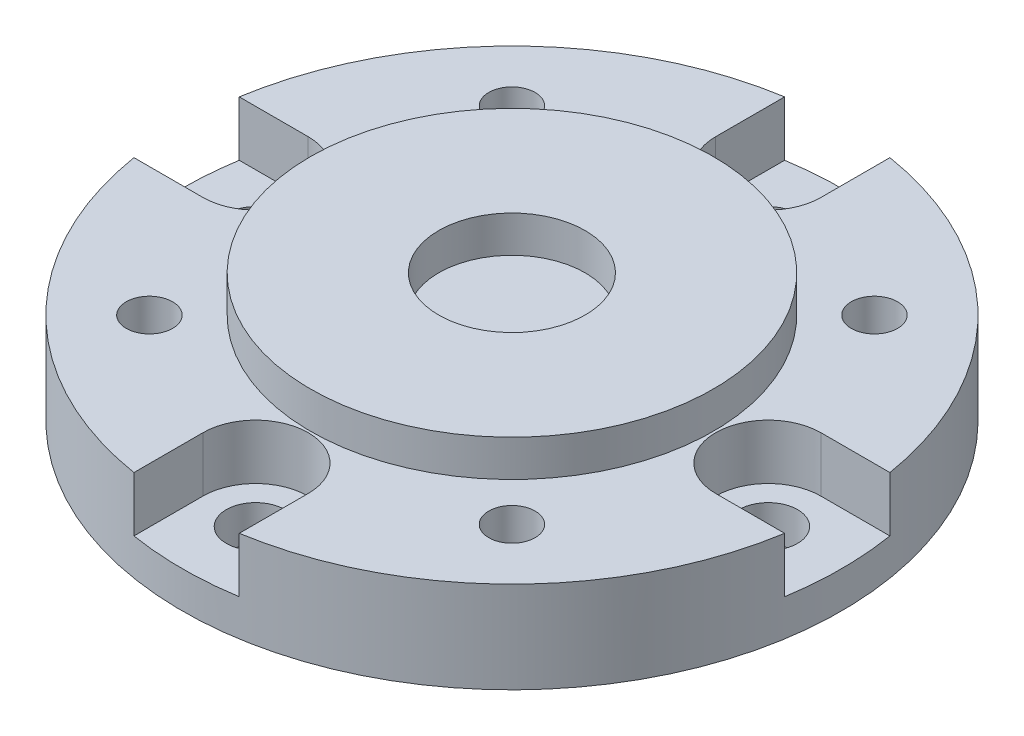
ISO-10303-21;
HEADER;
FILE_DESCRIPTION(('STEP AP214'),'2;1');
FILE_NAME('part.step','',(''),(''),'','','');
FILE_SCHEMA(('AUTOMOTIVE_DESIGN { 1 0 10303 214 1 1 1 1 }'));
ENDSEC;
DATA;
#1=APPLICATION_CONTEXT('core data for automotive mechanical design processes');
#2=APPLICATION_PROTOCOL_DEFINITION('international standard','automotive_design',2000,#1);
#3=PRODUCT_CONTEXT('',#1,'mechanical');
#4=PRODUCT('Part','Part','',(#3));
#5=PRODUCT_RELATED_PRODUCT_CATEGORY('part','',(#4));
#6=PRODUCT_DEFINITION_FORMATION('','',#4);
#7=PRODUCT_DEFINITION_CONTEXT('part definition',#1,'design');
#8=PRODUCT_DEFINITION('design','',#6,#7);
#9=PRODUCT_DEFINITION_SHAPE('','',#8);
#10=(LENGTH_UNIT() NAMED_UNIT(*) SI_UNIT(.MILLI.,.METRE.));
#11=(NAMED_UNIT(*) PLANE_ANGLE_UNIT() SI_UNIT($,.RADIAN.));
#12=(NAMED_UNIT(*) SI_UNIT($,.STERADIAN.) SOLID_ANGLE_UNIT());
#13=UNCERTAINTY_MEASURE_WITH_UNIT(LENGTH_MEASURE(1.E-05),#10,'distance_accuracy_value','');
#14=(GEOMETRIC_REPRESENTATION_CONTEXT(3) GLOBAL_UNCERTAINTY_ASSIGNED_CONTEXT((#13)) GLOBAL_UNIT_ASSIGNED_CONTEXT((#10,
#11,#12)) REPRESENTATION_CONTEXT('',''));
#15=CARTESIAN_POINT('',(0.,0.,0.));
#16=DIRECTION('',(0.,0.,1.));
#17=DIRECTION('',(1.,0.,0.));
#18=AXIS2_PLACEMENT_3D('',#15,#16,#17);
#19=CARTESIAN_POINT('',(0.,72.5,0.));
#20=DIRECTION('',(0.,1.,0.));
#21=DIRECTION('',(1.,0.,0.));
#22=AXIS2_PLACEMENT_3D('',#19,#20,#21);
#23=PLANE('',#22);
#24=CARTESIAN_POINT('',(-9.89949493661174,72.5,9.89949493661166));
#25=DIRECTION('',(0.,1.,0.));
#26=DIRECTION('',(0.,0.,1.));
#27=AXIS2_PLACEMENT_3D('',#24,#25,#26);
#28=CIRCLE('',#27,1.2645);
#29=CARTESIAN_POINT('',(-9.89949493661174,72.5,8.63499493661166));
#30=VERTEX_POINT('',#29);
#31=EDGE_CURVE('E444',#30,#30,#28,.T.);
#32=ORIENTED_EDGE('',*,*,#31,.T.);
#33=EDGE_LOOP('',(#32));
#34=FACE_BOUND('',#33,.T.);
#35=CARTESIAN_POINT('',(9.8994949366116,72.5,-9.89949493661166));
#36=DIRECTION('',(0.,1.,0.));
#37=DIRECTION('',(0.,0.,1.));
#38=AXIS2_PLACEMENT_3D('',#35,#36,#37);
#39=CIRCLE('',#38,1.2645);
#40=CARTESIAN_POINT('',(9.8994949366116,72.5,-11.1639949366117));
#41=VERTEX_POINT('',#40);
#42=EDGE_CURVE('E430',#41,#41,#39,.T.);
#43=ORIENTED_EDGE('',*,*,#42,.T.);
#44=EDGE_LOOP('',(#43));
#45=FACE_BOUND('',#44,.T.);
#46=CARTESIAN_POINT('',(9.89949493661159,72.5,9.89949493661166));
#47=DIRECTION('',(0.,1.,0.));
#48=DIRECTION('',(0.,0.,1.));
#49=AXIS2_PLACEMENT_3D('',#46,#47,#48);
#50=CIRCLE('',#49,1.2645);
#51=CARTESIAN_POINT('',(9.89949493661159,72.5,8.63499493661166));
#52=VERTEX_POINT('',#51);
#53=EDGE_CURVE('E455',#52,#52,#50,.T.);
#54=ORIENTED_EDGE('',*,*,#53,.T.);
#55=EDGE_LOOP('',(#54));
#56=FACE_BOUND('',#55,.T.);
#57=CARTESIAN_POINT('',(-9.89949493661174,72.5,-9.89949493661166));
#58=DIRECTION('',(0.,1.,0.));
#59=DIRECTION('',(0.,0.,1.));
#60=AXIS2_PLACEMENT_3D('',#57,#58,#59);
#61=CIRCLE('',#60,1.2645);
#62=CARTESIAN_POINT('',(-9.89949493661174,72.5,-11.1639949366117));
#63=VERTEX_POINT('',#62);
#64=EDGE_CURVE('E426',#63,#63,#61,.T.);
#65=ORIENTED_EDGE('',*,*,#64,.T.);
#66=EDGE_LOOP('',(#65));
#67=FACE_BOUND('',#66,.T.);
#68=CARTESIAN_POINT('',(0.,72.5,14.));
#69=DIRECTION('',(0.,1.,0.));
#70=DIRECTION('',(0.,0.,1.));
#71=AXIS2_PLACEMENT_3D('',#68,#69,#70);
#72=CIRCLE('',#71,1.6);
#73=CARTESIAN_POINT('',(0.,72.5,15.6));
#74=VERTEX_POINT('',#73);
#75=CARTESIAN_POINT('',(0.,72.5,12.4));
#76=VERTEX_POINT('',#75);
#77=EDGE_CURVE('E373',#74,#76,#72,.T.);
#78=ORIENTED_EDGE('',*,*,#77,.T.);
#79=CARTESIAN_POINT('',(0.,72.5,14.));
#80=DIRECTION('',(0.,1.,0.));
#81=DIRECTION('',(0.,0.,1.));
#82=AXIS2_PLACEMENT_3D('',#79,#80,#81);
#83=CIRCLE('',#82,1.6);
#84=EDGE_CURVE('E369',#76,#74,#83,.T.);
#85=ORIENTED_EDGE('',*,*,#84,.T.);
#86=EDGE_LOOP('',(#78,#85));
#87=FACE_BOUND('',#86,.T.);
#88=CARTESIAN_POINT('',(0.,72.5,-14.));
#89=DIRECTION('',(0.,1.,0.));
#90=DIRECTION('',(0.,0.,1.));
#91=AXIS2_PLACEMENT_3D('',#88,#89,#90);
#92=CIRCLE('',#91,1.6);
#93=CARTESIAN_POINT('',(0.,72.5,-12.4));
#94=VERTEX_POINT('',#93);
#95=CARTESIAN_POINT('',(0.,72.5,-15.6));
#96=VERTEX_POINT('',#95);
#97=EDGE_CURVE('E337',#94,#96,#92,.T.);
#98=ORIENTED_EDGE('',*,*,#97,.T.);
#99=CARTESIAN_POINT('',(0.,72.5,-14.));
#100=DIRECTION('',(0.,1.,0.));
#101=DIRECTION('',(0.,0.,1.));
#102=AXIS2_PLACEMENT_3D('',#99,#100,#101);
#103=CIRCLE('',#102,1.6);
#104=EDGE_CURVE('E341',#96,#94,#103,.T.);
#105=ORIENTED_EDGE('',*,*,#104,.T.);
#106=EDGE_LOOP('',(#98,#105));
#107=FACE_BOUND('',#106,.T.);
#108=CARTESIAN_POINT('',(-14.,72.5,0.));
#109=DIRECTION('',(0.,1.,0.));
#110=DIRECTION('',(0.,0.,1.));
#111=AXIS2_PLACEMENT_3D('',#108,#109,#110);
#112=CIRCLE('',#111,1.6);
#113=CARTESIAN_POINT('',(-14.,72.5,1.6));
#114=VERTEX_POINT('',#113);
#115=CARTESIAN_POINT('',(-14.,72.5,-1.6));
#116=VERTEX_POINT('',#115);
#117=EDGE_CURVE('E536',#114,#116,#112,.T.);
#118=ORIENTED_EDGE('',*,*,#117,.T.);
#119=CARTESIAN_POINT('',(-14.,72.5,0.));
#120=DIRECTION('',(0.,1.,0.));
#121=DIRECTION('',(0.,0.,1.));
#122=AXIS2_PLACEMENT_3D('',#119,#120,#121);
#123=CIRCLE('',#122,1.6);
#124=EDGE_CURVE('E306',#116,#114,#123,.T.);
#125=ORIENTED_EDGE('',*,*,#124,.T.);
#126=EDGE_LOOP('',(#118,#125));
#127=FACE_BOUND('',#126,.T.);
#128=CARTESIAN_POINT('',(14.,72.5,0.));
#129=DIRECTION('',(0.,1.,0.));
#130=DIRECTION('',(0.,0.,1.));
#131=AXIS2_PLACEMENT_3D('',#128,#129,#130);
#132=CIRCLE('',#131,1.6);
#133=CARTESIAN_POINT('',(14.,72.5,1.6));
#134=VERTEX_POINT('',#133);
#135=CARTESIAN_POINT('',(14.,72.5,-1.6));
#136=VERTEX_POINT('',#135);
#137=EDGE_CURVE('E363',#134,#136,#132,.T.);
#138=ORIENTED_EDGE('',*,*,#137,.T.);
#139=CARTESIAN_POINT('',(14.,72.5,0.));
#140=DIRECTION('',(0.,1.,0.));
#141=DIRECTION('',(0.,0.,1.));
#142=AXIS2_PLACEMENT_3D('',#139,#140,#141);
#143=CIRCLE('',#142,1.6);
#144=EDGE_CURVE('E359',#136,#134,#143,.T.);
#145=ORIENTED_EDGE('',*,*,#144,.T.);
#146=EDGE_LOOP('',(#138,#145));
#147=FACE_BOUND('',#146,.T.);
#148=CARTESIAN_POINT('',(0.,72.5,0.));
#149=DIRECTION('',(0.,-1.,0.));
#150=DIRECTION('',(1.,0.,0.));
#151=AXIS2_PLACEMENT_3D('',#148,#149,#150);
#152=CIRCLE('',#151,18.);
#153=CARTESIAN_POINT('',(-18.,72.5,0.));
#154=VERTEX_POINT('',#153);
#155=EDGE_CURVE('E19',#154,#154,#152,.T.);
#156=ORIENTED_EDGE('',*,*,#155,.T.);
#157=EDGE_LOOP('',(#156));
#158=FACE_BOUND('',#157,.T.);
#159=ADVANCED_FACE('F15',(#34,#45,#56,#67,#87,#107,#127,#147,#158),#23,.F.);
#160=CARTESIAN_POINT('',(0.,77.5,0.));
#161=DIRECTION('',(0.,1.,0.));
#162=DIRECTION('',(1.,0.,0.));
#163=AXIS2_PLACEMENT_3D('',#160,#161,#162);
#164=PLANE('',#163);
#165=CARTESIAN_POINT('',(0.,77.5,0.));
#166=DIRECTION('',(0.,1.,0.));
#167=DIRECTION('',(1.,0.,0.));
#168=AXIS2_PLACEMENT_3D('',#165,#166,#167);
#169=CIRCLE('',#168,4.);
#170=CARTESIAN_POINT('',(-4.00000000000007,77.5,0.));
#171=VERTEX_POINT('',#170);
#172=EDGE_CURVE('E327',#171,#171,#169,.T.);
#173=ORIENTED_EDGE('',*,*,#172,.T.);
#174=EDGE_LOOP('',(#173));
#175=FACE_BOUND('',#174,.T.);
#176=ADVANCED_FACE('F723',(#175),#164,.T.);
#177=CARTESIAN_POINT('',(0.,77.5,0.));
#178=DIRECTION('',(0.,-1.,0.));
#179=DIRECTION('',(1.,0.,0.));
#180=AXIS2_PLACEMENT_3D('',#177,#178,#179);
#181=CYLINDRICAL_SURFACE('',#180,18.);
#182=ORIENTED_EDGE('',*,*,#155,.F.);
#183=DIRECTION('',(0.,1.,0.));
#184=VECTOR('',#183,1.);
#185=CARTESIAN_POINT('',(-18.,77.5,0.));
#186=LINE('',#185,#184);
#187=CARTESIAN_POINT('',(-18.,74.5,0.));
#188=VERTEX_POINT('',#187);
#189=EDGE_CURVE('E10',#154,#188,#186,.T.);
#190=ORIENTED_EDGE('',*,*,#189,.T.);
#191=CARTESIAN_POINT('',(0.,74.5,0.));
#192=DIRECTION('',(0.,-1.,0.));
#193=DIRECTION('',(1.,0.,0.));
#194=AXIS2_PLACEMENT_3D('',#191,#192,#193);
#195=CIRCLE('',#194,18.);
#196=CARTESIAN_POINT('',(-17.7689159770652,74.5,-2.875));
#197=VERTEX_POINT('',#196);
#198=EDGE_CURVE('E478',#188,#197,#195,.T.);
#199=ORIENTED_EDGE('',*,*,#198,.T.);
#200=DIRECTION('',(0.,1.,0.));
#201=VECTOR('',#200,1.);
#202=CARTESIAN_POINT('',(-17.7689159770652,77.5,-2.875));
#203=LINE('',#202,#201);
#204=CARTESIAN_POINT('',(-17.7689159770652,77.5,-2.875));
#205=VERTEX_POINT('',#204);
#206=EDGE_CURVE('E499',#197,#205,#203,.T.);
#207=ORIENTED_EDGE('',*,*,#206,.T.);
#208=CARTESIAN_POINT('',(0.,77.5,0.));
#209=DIRECTION('',(0.,1.,0.));
#210=DIRECTION('',(1.,0.,0.));
#211=AXIS2_PLACEMENT_3D('',#208,#209,#210);
#212=CIRCLE('',#211,18.);
#213=CARTESIAN_POINT('',(-2.87500000000007,77.5,-17.7689159770651));
#214=VERTEX_POINT('',#213);
#215=EDGE_CURVE('E314',#214,#205,#212,.T.);
#216=ORIENTED_EDGE('',*,*,#215,.F.);
#217=DIRECTION('',(0.,-1.,0.));
#218=VECTOR('',#217,1.);
#219=CARTESIAN_POINT('',(-2.87500000000007,77.5,-17.7689159770651));
#220=LINE('',#219,#218);
#221=CARTESIAN_POINT('',(-2.87500000000007,74.5,-17.7689159770651));
#222=VERTEX_POINT('',#221);
#223=EDGE_CURVE('E345',#214,#222,#220,.T.);
#224=ORIENTED_EDGE('',*,*,#223,.T.);
#225=CARTESIAN_POINT('',(0.,74.5,0.));
#226=DIRECTION('',(0.,-1.,0.));
#227=DIRECTION('',(1.,0.,0.));
#228=AXIS2_PLACEMENT_3D('',#225,#226,#227);
#229=CIRCLE('',#228,18.);
#230=CARTESIAN_POINT('',(2.87499999999993,74.5,-17.7689159770651));
#231=VERTEX_POINT('',#230);
#232=EDGE_CURVE('E282',#222,#231,#229,.T.);
#233=ORIENTED_EDGE('',*,*,#232,.T.);
#234=DIRECTION('',(0.,1.,0.));
#235=VECTOR('',#234,1.);
#236=CARTESIAN_POINT('',(2.87499999999993,77.5,-17.7689159770651));
#237=LINE('',#236,#235);
#238=CARTESIAN_POINT('',(2.87499999999993,77.5,-17.7689159770651));
#239=VERTEX_POINT('',#238);
#240=EDGE_CURVE('E296',#231,#239,#237,.T.);
#241=ORIENTED_EDGE('',*,*,#240,.T.);
#242=CARTESIAN_POINT('',(0.,77.5,0.));
#243=DIRECTION('',(0.,1.,0.));
#244=DIRECTION('',(1.,0.,0.));
#245=AXIS2_PLACEMENT_3D('',#242,#243,#244);
#246=CIRCLE('',#245,18.);
#247=CARTESIAN_POINT('',(17.768915977065,77.5,-2.875));
#248=VERTEX_POINT('',#247);
#249=EDGE_CURVE('E335',#248,#239,#246,.T.);
#250=ORIENTED_EDGE('',*,*,#249,.F.);
#251=DIRECTION('',(0.,-1.,0.));
#252=VECTOR('',#251,1.);
#253=CARTESIAN_POINT('',(17.768915977065,77.5,-2.875));
#254=LINE('',#253,#252);
#255=CARTESIAN_POINT('',(17.768915977065,74.5,-2.875));
#256=VERTEX_POINT('',#255);
#257=EDGE_CURVE('E353',#248,#256,#254,.T.);
#258=ORIENTED_EDGE('',*,*,#257,.T.);
#259=CARTESIAN_POINT('',(0.,74.5,0.));
#260=DIRECTION('',(0.,-1.,0.));
#261=DIRECTION('',(1.,0.,0.));
#262=AXIS2_PLACEMENT_3D('',#259,#260,#261);
#263=CIRCLE('',#262,18.);
#264=CARTESIAN_POINT('',(17.768915977065,74.5,2.875));
#265=VERTEX_POINT('',#264);
#266=EDGE_CURVE('E493',#256,#265,#263,.T.);
#267=ORIENTED_EDGE('',*,*,#266,.T.);
#268=DIRECTION('',(0.,1.,0.));
#269=VECTOR('',#268,1.);
#270=CARTESIAN_POINT('',(17.768915977065,77.5,2.875));
#271=LINE('',#270,#269);
#272=CARTESIAN_POINT('',(17.768915977065,77.5,2.875));
#273=VERTEX_POINT('',#272);
#274=EDGE_CURVE('E549',#265,#273,#271,.T.);
#275=ORIENTED_EDGE('',*,*,#274,.T.);
#276=CARTESIAN_POINT('',(0.,77.5,0.));
#277=DIRECTION('',(0.,1.,0.));
#278=DIRECTION('',(1.,0.,0.));
#279=AXIS2_PLACEMENT_3D('',#276,#277,#278);
#280=CIRCLE('',#279,18.);
#281=CARTESIAN_POINT('',(2.87499999999993,77.5,17.7689159770651));
#282=VERTEX_POINT('',#281);
#283=EDGE_CURVE('E332',#282,#273,#280,.T.);
#284=ORIENTED_EDGE('',*,*,#283,.F.);
#285=DIRECTION('',(0.,-1.,0.));
#286=VECTOR('',#285,1.);
#287=CARTESIAN_POINT('',(2.87499999999993,77.5,17.7689159770651));
#288=LINE('',#287,#286);
#289=CARTESIAN_POINT('',(2.87499999999993,74.5,17.7689159770651));
#290=VERTEX_POINT('',#289);
#291=EDGE_CURVE('E490',#282,#290,#288,.T.);
#292=ORIENTED_EDGE('',*,*,#291,.T.);
#293=CARTESIAN_POINT('',(0.,74.5,0.));
#294=DIRECTION('',(0.,-1.,0.));
#295=DIRECTION('',(1.,0.,0.));
#296=AXIS2_PLACEMENT_3D('',#293,#294,#295);
#297=CIRCLE('',#296,18.);
#298=CARTESIAN_POINT('',(-2.87500000000007,74.5,17.7689159770651));
#299=VERTEX_POINT('',#298);
#300=EDGE_CURVE('E374',#290,#299,#297,.T.);
#301=ORIENTED_EDGE('',*,*,#300,.T.);
#302=DIRECTION('',(0.,1.,0.));
#303=VECTOR('',#302,1.);
#304=CARTESIAN_POINT('',(-2.87500000000007,77.5,17.7689159770651));
#305=LINE('',#304,#303);
#306=CARTESIAN_POINT('',(-2.87500000000007,77.5,17.7689159770651));
#307=VERTEX_POINT('',#306);
#308=EDGE_CURVE('E575',#299,#307,#305,.T.);
#309=ORIENTED_EDGE('',*,*,#308,.T.);
#310=CARTESIAN_POINT('',(0.,77.5,0.));
#311=DIRECTION('',(0.,1.,0.));
#312=DIRECTION('',(1.,0.,0.));
#313=AXIS2_PLACEMENT_3D('',#310,#311,#312);
#314=CIRCLE('',#313,18.);
#315=CARTESIAN_POINT('',(-17.7689159770652,77.5,2.875));
#316=VERTEX_POINT('',#315);
#317=EDGE_CURVE('E336',#316,#307,#314,.T.);
#318=ORIENTED_EDGE('',*,*,#317,.F.);
#319=DIRECTION('',(0.,-1.,0.));
#320=VECTOR('',#319,1.);
#321=CARTESIAN_POINT('',(-17.7689159770652,77.5,2.875));
#322=LINE('',#321,#320);
#323=CARTESIAN_POINT('',(-17.7689159770652,74.5,2.875));
#324=VERTEX_POINT('',#323);
#325=EDGE_CURVE('E351',#316,#324,#322,.T.);
#326=ORIENTED_EDGE('',*,*,#325,.T.);
#327=CARTESIAN_POINT('',(0.,74.5,0.));
#328=DIRECTION('',(0.,-1.,0.));
#329=DIRECTION('',(1.,0.,0.));
#330=AXIS2_PLACEMENT_3D('',#327,#328,#329);
#331=CIRCLE('',#330,18.);
#332=EDGE_CURVE('E479',#324,#188,#331,.T.);
#333=ORIENTED_EDGE('',*,*,#332,.T.);
#334=ORIENTED_EDGE('',*,*,#189,.F.);
#335=EDGE_LOOP('',(#182,#190,#199,#207,#216,#224,#233,#241,#250,#258,#267,#275,#284,#292,#301,
#309,#318,#326,#333,#334));
#336=FACE_BOUND('',#335,.T.);
#337=ADVANCED_FACE('F17',(#336),#181,.T.);
#338=CARTESIAN_POINT('',(0.,79.5,0.));
#339=DIRECTION('',(0.,1.,0.));
#340=DIRECTION('',(1.,0.,0.));
#341=AXIS2_PLACEMENT_3D('',#338,#339,#340);
#342=PLANE('',#341);
#343=CARTESIAN_POINT('',(0.,79.5,0.));
#344=DIRECTION('',(0.,-1.,0.));
#345=DIRECTION('',(1.,0.,0.));
#346=AXIS2_PLACEMENT_3D('',#343,#344,#345);
#347=CIRCLE('',#346,4.);
#348=CARTESIAN_POINT('',(-4.00000000000007,79.5,0.));
#349=VERTEX_POINT('',#348);
#350=EDGE_CURVE('E436',#349,#349,#347,.T.);
#351=ORIENTED_EDGE('',*,*,#350,.T.);
#352=EDGE_LOOP('',(#351));
#353=FACE_BOUND('',#352,.T.);
#354=CARTESIAN_POINT('',(0.,79.5,0.));
#355=DIRECTION('',(0.,1.,0.));
#356=DIRECTION('',(1.,0.,0.));
#357=AXIS2_PLACEMENT_3D('',#354,#355,#356);
#358=CIRCLE('',#357,11.);
#359=CARTESIAN_POINT('',(-11.,79.5,0.));
#360=VERTEX_POINT('',#359);
#361=EDGE_CURVE('E330',#360,#360,#358,.T.);
#362=ORIENTED_EDGE('',*,*,#361,.T.);
#363=EDGE_LOOP('',(#362));
#364=FACE_BOUND('',#363,.T.);
#365=ADVANCED_FACE('F745',(#353,#364),#342,.T.);
#366=CARTESIAN_POINT('',(0.,77.5,0.));
#367=DIRECTION('',(0.,1.,0.));
#368=DIRECTION('',(1.,0.,0.));
#369=AXIS2_PLACEMENT_3D('',#366,#367,#368);
#370=CYLINDRICAL_SURFACE('',#369,11.);
#371=ORIENTED_EDGE('',*,*,#361,.F.);
#372=DIRECTION('',(0.,-1.,0.));
#373=VECTOR('',#372,1.);
#374=CARTESIAN_POINT('',(-11.,77.5,0.));
#375=LINE('',#374,#373);
#376=CARTESIAN_POINT('',(-11.,77.5,0.));
#377=VERTEX_POINT('',#376);
#378=EDGE_CURVE('E386',#360,#377,#375,.T.);
#379=ORIENTED_EDGE('',*,*,#378,.T.);
#380=CARTESIAN_POINT('',(0.,77.5,0.));
#381=DIRECTION('',(0.,-1.,0.));
#382=DIRECTION('',(1.,0.,0.));
#383=AXIS2_PLACEMENT_3D('',#380,#381,#382);
#384=CIRCLE('',#383,11.);
#385=EDGE_CURVE('E309',#377,#377,#384,.T.);
#386=ORIENTED_EDGE('',*,*,#385,.F.);
#387=ORIENTED_EDGE('',*,*,#378,.F.);
#388=EDGE_LOOP('',(#371,#379,#386,#387));
#389=FACE_BOUND('',#388,.T.);
#390=ADVANCED_FACE('F743',(#389),#370,.T.);
#391=CARTESIAN_POINT('',(0.,77.5,0.));
#392=DIRECTION('',(0.,1.,0.));
#393=DIRECTION('',(1.,0.,0.));
#394=AXIS2_PLACEMENT_3D('',#391,#392,#393);
#395=CYLINDRICAL_SURFACE('',#394,4.);
#396=ORIENTED_EDGE('',*,*,#350,.F.);
#397=DIRECTION('',(0.,-1.,0.));
#398=VECTOR('',#397,1.);
#399=CARTESIAN_POINT('',(-4.00000000000007,77.5,0.));
#400=LINE('',#399,#398);
#401=EDGE_CURVE('E331',#349,#171,#400,.T.);
#402=ORIENTED_EDGE('',*,*,#401,.T.);
#403=ORIENTED_EDGE('',*,*,#172,.F.);
#404=ORIENTED_EDGE('',*,*,#401,.F.);
#405=EDGE_LOOP('',(#396,#402,#403,#404));
#406=FACE_BOUND('',#405,.T.);
#407=ADVANCED_FACE('F753',(#406),#395,.F.);
#408=CARTESIAN_POINT('',(-9.89949493661174,73.5,9.89949493661166));
#409=DIRECTION('',(0.,-1.,0.));
#410=DIRECTION('',(0.,0.,1.));
#411=AXIS2_PLACEMENT_3D('',#408,#409,#410);
#412=CYLINDRICAL_SURFACE('',#411,1.2645);
#413=CARTESIAN_POINT('',(-9.89949493661174,77.5,9.89949493661166));
#414=DIRECTION('',(0.,-1.,0.));
#415=DIRECTION('',(0.,0.,1.));
#416=AXIS2_PLACEMENT_3D('',#413,#414,#415);
#417=CIRCLE('',#416,1.2645);
#418=CARTESIAN_POINT('',(-9.89949493661174,77.5,11.1639949366117));
#419=VERTEX_POINT('',#418);
#420=CARTESIAN_POINT('',(-9.89949493661174,77.5,8.63499493661166));
#421=VERTEX_POINT('',#420);
#422=EDGE_CURVE('E313',#419,#421,#417,.T.);
#423=ORIENTED_EDGE('',*,*,#422,.F.);
#424=CARTESIAN_POINT('',(-9.89949493661174,77.5,9.89949493661166));
#425=DIRECTION('',(0.,-1.,0.));
#426=DIRECTION('',(0.,0.,1.));
#427=AXIS2_PLACEMENT_3D('',#424,#425,#426);
#428=CIRCLE('',#427,1.2645);
#429=EDGE_CURVE('E320',#421,#419,#428,.T.);
#430=ORIENTED_EDGE('',*,*,#429,.F.);
#431=DIRECTION('',(0.,-1.,0.));
#432=VECTOR('',#431,1.);
#433=CARTESIAN_POINT('',(-9.89949493661174,73.5,8.63499493661166));
#434=LINE('',#433,#432);
#435=EDGE_CURVE('E432',#421,#30,#434,.T.);
#436=ORIENTED_EDGE('',*,*,#435,.T.);
#437=ORIENTED_EDGE('',*,*,#31,.F.);
#438=ORIENTED_EDGE('',*,*,#435,.F.);
#439=EDGE_LOOP('',(#423,#430,#436,#437,#438));
#440=FACE_BOUND('',#439,.T.);
#441=ADVANCED_FACE('F595',(#440),#412,.F.);
#442=CARTESIAN_POINT('',(9.8994949366116,73.5,-9.89949493661166));
#443=DIRECTION('',(0.,-1.,0.));
#444=DIRECTION('',(0.,0.,1.));
#445=AXIS2_PLACEMENT_3D('',#442,#443,#444);
#446=CYLINDRICAL_SURFACE('',#445,1.2645);
#447=CARTESIAN_POINT('',(9.8994949366116,77.5,-9.89949493661166));
#448=DIRECTION('',(0.,-1.,0.));
#449=DIRECTION('',(0.,0.,1.));
#450=AXIS2_PLACEMENT_3D('',#447,#448,#449);
#451=CIRCLE('',#450,1.2645);
#452=CARTESIAN_POINT('',(9.8994949366116,77.5,-8.63499493661166));
#453=VERTEX_POINT('',#452);
#454=CARTESIAN_POINT('',(9.8994949366116,77.5,-11.1639949366117));
#455=VERTEX_POINT('',#454);
#456=EDGE_CURVE('E315',#453,#455,#451,.T.);
#457=ORIENTED_EDGE('',*,*,#456,.F.);
#458=CARTESIAN_POINT('',(9.8994949366116,77.5,-9.89949493661166));
#459=DIRECTION('',(0.,-1.,0.));
#460=DIRECTION('',(0.,0.,1.));
#461=AXIS2_PLACEMENT_3D('',#458,#459,#460);
#462=CIRCLE('',#461,1.2645);
#463=EDGE_CURVE('E319',#455,#453,#462,.T.);
#464=ORIENTED_EDGE('',*,*,#463,.F.);
#465=DIRECTION('',(0.,-1.,0.));
#466=VECTOR('',#465,1.);
#467=CARTESIAN_POINT('',(9.8994949366116,73.5,-11.1639949366117));
#468=LINE('',#467,#466);
#469=EDGE_CURVE('E433',#455,#41,#468,.T.);
#470=ORIENTED_EDGE('',*,*,#469,.T.);
#471=ORIENTED_EDGE('',*,*,#42,.F.);
#472=ORIENTED_EDGE('',*,*,#469,.F.);
#473=EDGE_LOOP('',(#457,#464,#470,#471,#472));
#474=FACE_BOUND('',#473,.T.);
#475=ADVANCED_FACE('F774',(#474),#446,.F.);
#476=CARTESIAN_POINT('',(9.89949493661159,73.5,9.89949493661166));
#477=DIRECTION('',(0.,-1.,0.));
#478=DIRECTION('',(0.,0.,1.));
#479=AXIS2_PLACEMENT_3D('',#476,#477,#478);
#480=CYLINDRICAL_SURFACE('',#479,1.2645);
#481=CARTESIAN_POINT('',(9.89949493661159,77.5,9.89949493661166));
#482=DIRECTION('',(0.,-1.,0.));
#483=DIRECTION('',(0.,0.,1.));
#484=AXIS2_PLACEMENT_3D('',#481,#482,#483);
#485=CIRCLE('',#484,1.2645);
#486=CARTESIAN_POINT('',(9.89949493661159,77.5,11.1639949366117));
#487=VERTEX_POINT('',#486);
#488=CARTESIAN_POINT('',(9.89949493661159,77.5,8.63499493661166));
#489=VERTEX_POINT('',#488);
#490=EDGE_CURVE('E326',#487,#489,#485,.T.);
#491=ORIENTED_EDGE('',*,*,#490,.F.);
#492=CARTESIAN_POINT('',(9.89949493661159,77.5,9.89949493661166));
#493=DIRECTION('',(0.,-1.,0.));
#494=DIRECTION('',(0.,0.,1.));
#495=AXIS2_PLACEMENT_3D('',#492,#493,#494);
#496=CIRCLE('',#495,1.2645);
#497=EDGE_CURVE('E321',#489,#487,#496,.T.);
#498=ORIENTED_EDGE('',*,*,#497,.F.);
#499=DIRECTION('',(0.,-1.,0.));
#500=VECTOR('',#499,1.);
#501=CARTESIAN_POINT('',(9.89949493661159,73.5,8.63499493661166));
#502=LINE('',#501,#500);
#503=EDGE_CURVE('E429',#489,#52,#502,.T.);
#504=ORIENTED_EDGE('',*,*,#503,.T.);
#505=ORIENTED_EDGE('',*,*,#53,.F.);
#506=ORIENTED_EDGE('',*,*,#503,.F.);
#507=EDGE_LOOP('',(#491,#498,#504,#505,#506));
#508=FACE_BOUND('',#507,.T.);
#509=ADVANCED_FACE('F786',(#508),#480,.F.);
#510=CARTESIAN_POINT('',(-9.89949493661174,73.5,-9.89949493661166));
#511=DIRECTION('',(0.,-1.,0.));
#512=DIRECTION('',(0.,0.,1.));
#513=AXIS2_PLACEMENT_3D('',#510,#511,#512);
#514=CYLINDRICAL_SURFACE('',#513,1.2645);
#515=CARTESIAN_POINT('',(-9.89949493661174,77.5,-9.89949493661166));
#516=DIRECTION('',(0.,-1.,0.));
#517=DIRECTION('',(0.,0.,1.));
#518=AXIS2_PLACEMENT_3D('',#515,#516,#517);
#519=CIRCLE('',#518,1.2645);
#520=CARTESIAN_POINT('',(-9.89949493661174,77.5,-8.63499493661166));
#521=VERTEX_POINT('',#520);
#522=CARTESIAN_POINT('',(-9.89949493661174,77.5,-11.1639949366117));
#523=VERTEX_POINT('',#522);
#524=EDGE_CURVE('E325',#521,#523,#519,.T.);
#525=ORIENTED_EDGE('',*,*,#524,.F.);
#526=CARTESIAN_POINT('',(-9.89949493661174,77.5,-9.89949493661166));
#527=DIRECTION('',(0.,-1.,0.));
#528=DIRECTION('',(0.,0.,1.));
#529=AXIS2_PLACEMENT_3D('',#526,#527,#528);
#530=CIRCLE('',#529,1.2645);
#531=EDGE_CURVE('E389',#523,#521,#530,.T.);
#532=ORIENTED_EDGE('',*,*,#531,.F.);
#533=DIRECTION('',(0.,-1.,0.));
#534=VECTOR('',#533,1.);
#535=CARTESIAN_POINT('',(-9.89949493661174,73.5,-11.1639949366117));
#536=LINE('',#535,#534);
#537=EDGE_CURVE('E422',#523,#63,#536,.T.);
#538=ORIENTED_EDGE('',*,*,#537,.T.);
#539=ORIENTED_EDGE('',*,*,#64,.F.);
#540=ORIENTED_EDGE('',*,*,#537,.F.);
#541=EDGE_LOOP('',(#525,#532,#538,#539,#540));
#542=FACE_BOUND('',#541,.T.);
#543=ADVANCED_FACE('F642',(#542),#514,.F.);
#544=CARTESIAN_POINT('',(0.,77.5,0.));
#545=DIRECTION('',(0.,1.,0.));
#546=DIRECTION('',(1.,0.,0.));
#547=AXIS2_PLACEMENT_3D('',#544,#545,#546);
#548=PLANE('',#547);
#549=ORIENTED_EDGE('',*,*,#524,.T.);
#550=ORIENTED_EDGE('',*,*,#531,.T.);
#551=EDGE_LOOP('',(#549,#550));
#552=FACE_BOUND('',#551,.T.);
#553=ORIENTED_EDGE('',*,*,#490,.T.);
#554=ORIENTED_EDGE('',*,*,#497,.T.);
#555=EDGE_LOOP('',(#553,#554));
#556=FACE_BOUND('',#555,.T.);
#557=ORIENTED_EDGE('',*,*,#456,.T.);
#558=ORIENTED_EDGE('',*,*,#463,.T.);
#559=EDGE_LOOP('',(#557,#558));
#560=FACE_BOUND('',#559,.T.);
#561=ORIENTED_EDGE('',*,*,#422,.T.);
#562=ORIENTED_EDGE('',*,*,#429,.T.);
#563=EDGE_LOOP('',(#561,#562));
#564=FACE_BOUND('',#563,.T.);
#565=ORIENTED_EDGE('',*,*,#385,.T.);
#566=EDGE_LOOP('',(#565));
#567=FACE_BOUND('',#566,.T.);
#568=DIRECTION('',(1.,0.,0.));
#569=VECTOR('',#568,1.);
#570=CARTESIAN_POINT('',(-8.88445798853263,77.5,-2.875));
#571=LINE('',#570,#569);
#572=CARTESIAN_POINT('',(-14.,77.5,-2.875));
#573=VERTEX_POINT('',#572);
#574=EDGE_CURVE('E402',#205,#573,#571,.T.);
#575=ORIENTED_EDGE('',*,*,#574,.T.);
#576=CARTESIAN_POINT('',(-14.,77.5,0.));
#577=DIRECTION('',(0.,-1.,0.));
#578=DIRECTION('',(0.,0.,1.));
#579=AXIS2_PLACEMENT_3D('',#576,#577,#578);
#580=CIRCLE('',#579,2.875);
#581=CARTESIAN_POINT('',(-14.,77.5,2.875));
#582=VERTEX_POINT('',#581);
#583=EDGE_CURVE('E394',#573,#582,#580,.T.);
#584=ORIENTED_EDGE('',*,*,#583,.T.);
#585=DIRECTION('',(-1.,0.,0.));
#586=VECTOR('',#585,1.);
#587=CARTESIAN_POINT('',(-7.,77.5,2.875));
#588=LINE('',#587,#586);
#589=EDGE_CURVE('E372',#582,#316,#588,.T.);
#590=ORIENTED_EDGE('',*,*,#589,.T.);
#591=ORIENTED_EDGE('',*,*,#317,.T.);
#592=DIRECTION('',(0.,0.,-1.));
#593=VECTOR('',#592,1.);
#594=CARTESIAN_POINT('',(-2.87500000000007,77.5,8.88445798853256));
#595=LINE('',#594,#593);
#596=CARTESIAN_POINT('',(-2.87500000000007,77.5,14.));
#597=VERTEX_POINT('',#596);
#598=EDGE_CURVE('E579',#307,#597,#595,.T.);
#599=ORIENTED_EDGE('',*,*,#598,.T.);
#600=CARTESIAN_POINT('',(0.,77.5,14.));
#601=DIRECTION('',(0.,-1.,0.));
#602=DIRECTION('',(1.,0.,0.));
#603=AXIS2_PLACEMENT_3D('',#600,#601,#602);
#604=CIRCLE('',#603,2.875);
#605=CARTESIAN_POINT('',(2.87499999999993,77.5,14.));
#606=VERTEX_POINT('',#605);
#607=EDGE_CURVE('E486',#597,#606,#604,.T.);
#608=ORIENTED_EDGE('',*,*,#607,.T.);
#609=DIRECTION('',(0.,0.,1.));
#610=VECTOR('',#609,1.);
#611=CARTESIAN_POINT('',(2.87499999999993,77.5,7.));
#612=LINE('',#611,#610);
#613=EDGE_CURVE('E364',#606,#282,#612,.T.);
#614=ORIENTED_EDGE('',*,*,#613,.T.);
#615=ORIENTED_EDGE('',*,*,#283,.T.);
#616=DIRECTION('',(-1.,0.,0.));
#617=VECTOR('',#616,1.);
#618=CARTESIAN_POINT('',(8.88445798853249,77.5,2.875));
#619=LINE('',#618,#617);
#620=CARTESIAN_POINT('',(14.,77.5,2.875));
#621=VERTEX_POINT('',#620);
#622=EDGE_CURVE('E667',#273,#621,#619,.T.);
#623=ORIENTED_EDGE('',*,*,#622,.T.);
#624=CARTESIAN_POINT('',(14.,77.5,0.));
#625=DIRECTION('',(0.,-1.,0.));
#626=DIRECTION('',(0.,0.,-1.));
#627=AXIS2_PLACEMENT_3D('',#624,#625,#626);
#628=CIRCLE('',#627,2.875);
#629=CARTESIAN_POINT('',(14.,77.5,-2.875));
#630=VERTEX_POINT('',#629);
#631=EDGE_CURVE('E357',#621,#630,#628,.T.);
#632=ORIENTED_EDGE('',*,*,#631,.T.);
#633=DIRECTION('',(1.,0.,0.));
#634=VECTOR('',#633,1.);
#635=CARTESIAN_POINT('',(7.,77.5,-2.875));
#636=LINE('',#635,#634);
#637=EDGE_CURVE('E421',#630,#248,#636,.T.);
#638=ORIENTED_EDGE('',*,*,#637,.T.);
#639=ORIENTED_EDGE('',*,*,#249,.T.);
#640=DIRECTION('',(0.,0.,1.));
#641=VECTOR('',#640,1.);
#642=CARTESIAN_POINT('',(2.87499999999993,77.5,-8.88445798853256));
#643=LINE('',#642,#641);
#644=CARTESIAN_POINT('',(2.87499999999993,77.5,-14.));
#645=VERTEX_POINT('',#644);
#646=EDGE_CURVE('E303',#239,#645,#643,.T.);
#647=ORIENTED_EDGE('',*,*,#646,.T.);
#648=CARTESIAN_POINT('',(0.,77.5,-14.));
#649=DIRECTION('',(0.,-1.,0.));
#650=DIRECTION('',(-1.,0.,0.));
#651=AXIS2_PLACEMENT_3D('',#648,#649,#650);
#652=CIRCLE('',#651,2.875);
#653=CARTESIAN_POINT('',(-2.87500000000007,77.5,-14.));
#654=VERTEX_POINT('',#653);
#655=EDGE_CURVE('E283',#645,#654,#652,.T.);
#656=ORIENTED_EDGE('',*,*,#655,.T.);
#657=DIRECTION('',(0.,0.,-1.));
#658=VECTOR('',#657,1.);
#659=CARTESIAN_POINT('',(-2.87500000000007,77.5,-7.));
#660=LINE('',#659,#658);
#661=EDGE_CURVE('E292',#654,#214,#660,.T.);
#662=ORIENTED_EDGE('',*,*,#661,.T.);
#663=ORIENTED_EDGE('',*,*,#215,.T.);
#664=EDGE_LOOP('',(#575,#584,#590,#591,#599,#608,#614,#615,#623,#632,#638,#639,#647,#656,#662,#663));
#665=FACE_BOUND('',#664,.T.);
#666=ADVANCED_FACE('F638',(#552,#556,#560,#564,#567,#665),#548,.T.);
#667=CARTESIAN_POINT('',(0.,74.5,14.5625));
#668=DIRECTION('',(0.,1.,0.));
#669=DIRECTION('',(1.,0.,0.));
#670=AXIS2_PLACEMENT_3D('',#667,#668,#669);
#671=PLANE('',#670);
#672=CARTESIAN_POINT('',(0.,74.5,14.));
#673=DIRECTION('',(0.,-1.,0.));
#674=DIRECTION('',(0.,0.,1.));
#675=AXIS2_PLACEMENT_3D('',#672,#673,#674);
#676=CIRCLE('',#675,1.6);
#677=CARTESIAN_POINT('',(0.,74.5,12.4));
#678=VERTEX_POINT('',#677);
#679=EDGE_CURVE('E382',#678,#678,#676,.T.);
#680=ORIENTED_EDGE('',*,*,#679,.T.);
#681=EDGE_LOOP('',(#680));
#682=FACE_BOUND('',#681,.T.);
#683=ORIENTED_EDGE('',*,*,#300,.F.);
#684=DIRECTION('',(0.,0.,1.));
#685=VECTOR('',#684,1.);
#686=CARTESIAN_POINT('',(2.87499999999993,74.5,19.));
#687=LINE('',#686,#685);
#688=CARTESIAN_POINT('',(2.87499999999993,74.5,14.));
#689=VERTEX_POINT('',#688);
#690=EDGE_CURVE('E506',#689,#290,#687,.T.);
#691=ORIENTED_EDGE('',*,*,#690,.F.);
#692=CARTESIAN_POINT('',(0.,74.5,14.));
#693=DIRECTION('',(0.,-1.,0.));
#694=DIRECTION('',(1.,0.,0.));
#695=AXIS2_PLACEMENT_3D('',#692,#693,#694);
#696=CIRCLE('',#695,2.875);
#697=CARTESIAN_POINT('',(-2.87500000000007,74.5,14.));
#698=VERTEX_POINT('',#697);
#699=EDGE_CURVE('E520',#698,#689,#696,.T.);
#700=ORIENTED_EDGE('',*,*,#699,.F.);
#701=DIRECTION('',(0.,0.,-1.));
#702=VECTOR('',#701,1.);
#703=CARTESIAN_POINT('',(-2.87500000000007,74.5,14.));
#704=LINE('',#703,#702);
#705=EDGE_CURVE('E377',#299,#698,#704,.T.);
#706=ORIENTED_EDGE('',*,*,#705,.F.);
#707=EDGE_LOOP('',(#683,#691,#700,#706));
#708=FACE_BOUND('',#707,.T.);
#709=ADVANCED_FACE('F641',(#682,#708),#671,.T.);
#710=CARTESIAN_POINT('',(-2.87500000000007,77.5,17.7689159770651));
#711=DIRECTION('',(-1.,0.,0.));
#712=DIRECTION('',(0.,0.,1.));
#713=AXIS2_PLACEMENT_3D('',#710,#711,#712);
#714=PLANE('',#713);
#715=ORIENTED_EDGE('',*,*,#598,.F.);
#716=ORIENTED_EDGE('',*,*,#308,.F.);
#717=ORIENTED_EDGE('',*,*,#705,.T.);
#718=DIRECTION('',(0.,-1.,0.));
#719=VECTOR('',#718,1.);
#720=CARTESIAN_POINT('',(-2.87500000000007,77.5,14.));
#721=LINE('',#720,#719);
#722=EDGE_CURVE('E489',#597,#698,#721,.T.);
#723=ORIENTED_EDGE('',*,*,#722,.F.);
#724=EDGE_LOOP('',(#715,#716,#717,#723));
#725=FACE_BOUND('',#724,.T.);
#726=ADVANCED_FACE('F696',(#725),#714,.F.);
#727=CARTESIAN_POINT('',(0.,77.5,14.));
#728=DIRECTION('',(0.,-1.,0.));
#729=DIRECTION('',(1.,0.,0.));
#730=AXIS2_PLACEMENT_3D('',#727,#728,#729);
#731=CYLINDRICAL_SURFACE('',#730,2.875);
#732=ORIENTED_EDGE('',*,*,#607,.F.);
#733=ORIENTED_EDGE('',*,*,#722,.T.);
#734=ORIENTED_EDGE('',*,*,#699,.T.);
#735=DIRECTION('',(0.,-1.,0.));
#736=VECTOR('',#735,1.);
#737=CARTESIAN_POINT('',(2.87499999999993,77.5,14.));
#738=LINE('',#737,#736);
#739=EDGE_CURVE('E368',#606,#689,#738,.T.);
#740=ORIENTED_EDGE('',*,*,#739,.F.);
#741=EDGE_LOOP('',(#732,#733,#734,#740));
#742=FACE_BOUND('',#741,.T.);
#743=ADVANCED_FACE('F700',(#742),#731,.F.);
#744=CARTESIAN_POINT('',(2.87499999999993,77.5,14.));
#745=DIRECTION('',(1.,0.,0.));
#746=DIRECTION('',(0.,0.,1.));
#747=AXIS2_PLACEMENT_3D('',#744,#745,#746);
#748=PLANE('',#747);
#749=ORIENTED_EDGE('',*,*,#613,.F.);
#750=ORIENTED_EDGE('',*,*,#739,.T.);
#751=ORIENTED_EDGE('',*,*,#690,.T.);
#752=ORIENTED_EDGE('',*,*,#291,.F.);
#753=EDGE_LOOP('',(#749,#750,#751,#752));
#754=FACE_BOUND('',#753,.T.);
#755=ADVANCED_FACE('F705',(#754),#748,.F.);
#756=CARTESIAN_POINT('',(0.,74.5,-14.5625));
#757=DIRECTION('',(0.,1.,0.));
#758=DIRECTION('',(1.,0.,0.));
#759=AXIS2_PLACEMENT_3D('',#756,#757,#758);
#760=PLANE('',#759);
#761=CARTESIAN_POINT('',(0.,74.5,-14.));
#762=DIRECTION('',(0.,-1.,0.));
#763=DIRECTION('',(0.,0.,1.));
#764=AXIS2_PLACEMENT_3D('',#761,#762,#763);
#765=CIRCLE('',#764,1.6);
#766=CARTESIAN_POINT('',(0.,74.5,-15.6));
#767=VERTEX_POINT('',#766);
#768=EDGE_CURVE('E562',#767,#767,#765,.T.);
#769=ORIENTED_EDGE('',*,*,#768,.T.);
#770=EDGE_LOOP('',(#769));
#771=FACE_BOUND('',#770,.T.);
#772=CARTESIAN_POINT('',(0.,74.5,-14.));
#773=DIRECTION('',(0.,-1.,0.));
#774=DIRECTION('',(-1.,0.,0.));
#775=AXIS2_PLACEMENT_3D('',#772,#773,#774);
#776=CIRCLE('',#775,2.875);
#777=CARTESIAN_POINT('',(2.87499999999993,74.5,-14.));
#778=VERTEX_POINT('',#777);
#779=CARTESIAN_POINT('',(-2.87500000000007,74.5,-14.));
#780=VERTEX_POINT('',#779);
#781=EDGE_CURVE('E270',#778,#780,#776,.T.);
#782=ORIENTED_EDGE('',*,*,#781,.F.);
#783=DIRECTION('',(0.,0.,1.));
#784=VECTOR('',#783,1.);
#785=CARTESIAN_POINT('',(2.87499999999993,74.5,-14.));
#786=LINE('',#785,#784);
#787=EDGE_CURVE('E274',#231,#778,#786,.T.);
#788=ORIENTED_EDGE('',*,*,#787,.F.);
#789=ORIENTED_EDGE('',*,*,#232,.F.);
#790=DIRECTION('',(0.,0.,-1.));
#791=VECTOR('',#790,1.);
#792=CARTESIAN_POINT('',(-2.87500000000007,74.5,-19.));
#793=LINE('',#792,#791);
#794=EDGE_CURVE('E277',#780,#222,#793,.T.);
#795=ORIENTED_EDGE('',*,*,#794,.F.);
#796=EDGE_LOOP('',(#782,#788,#789,#795));
#797=FACE_BOUND('',#796,.T.);
#798=ADVANCED_FACE('F272',(#771,#797),#760,.T.);
#799=CARTESIAN_POINT('',(0.,77.5,-14.));
#800=DIRECTION('',(0.,-1.,0.));
#801=DIRECTION('',(-1.,0.,0.));
#802=AXIS2_PLACEMENT_3D('',#799,#800,#801);
#803=CYLINDRICAL_SURFACE('',#802,2.875);
#804=ORIENTED_EDGE('',*,*,#655,.F.);
#805=DIRECTION('',(0.,-1.,0.));
#806=VECTOR('',#805,1.);
#807=CARTESIAN_POINT('',(2.87499999999993,77.5,-14.));
#808=LINE('',#807,#806);
#809=EDGE_CURVE('E286',#645,#778,#808,.T.);
#810=ORIENTED_EDGE('',*,*,#809,.T.);
#811=ORIENTED_EDGE('',*,*,#781,.T.);
#812=DIRECTION('',(0.,-1.,0.));
#813=VECTOR('',#812,1.);
#814=CARTESIAN_POINT('',(-2.87500000000007,77.5,-14.));
#815=LINE('',#814,#813);
#816=EDGE_CURVE('E346',#654,#780,#815,.T.);
#817=ORIENTED_EDGE('',*,*,#816,.F.);
#818=EDGE_LOOP('',(#804,#810,#811,#817));
#819=FACE_BOUND('',#818,.T.);
#820=ADVANCED_FACE('F287',(#819),#803,.F.);
#821=CARTESIAN_POINT('',(-2.87500000000007,77.5,-14.));
#822=DIRECTION('',(-1.,0.,0.));
#823=DIRECTION('',(0.,0.,1.));
#824=AXIS2_PLACEMENT_3D('',#821,#822,#823);
#825=PLANE('',#824);
#826=ORIENTED_EDGE('',*,*,#661,.F.);
#827=ORIENTED_EDGE('',*,*,#816,.T.);
#828=ORIENTED_EDGE('',*,*,#794,.T.);
#829=ORIENTED_EDGE('',*,*,#223,.F.);
#830=EDGE_LOOP('',(#826,#827,#828,#829));
#831=FACE_BOUND('',#830,.T.);
#832=ADVANCED_FACE('F765',(#831),#825,.F.);
#833=CARTESIAN_POINT('',(2.87499999999993,77.5,-17.7689159770651));
#834=DIRECTION('',(1.,0.,0.));
#835=DIRECTION('',(0.,1.,0.));
#836=AXIS2_PLACEMENT_3D('',#833,#834,#835);
#837=PLANE('',#836);
#838=ORIENTED_EDGE('',*,*,#646,.F.);
#839=ORIENTED_EDGE('',*,*,#240,.F.);
#840=ORIENTED_EDGE('',*,*,#787,.T.);
#841=ORIENTED_EDGE('',*,*,#809,.F.);
#842=EDGE_LOOP('',(#838,#839,#840,#841));
#843=FACE_BOUND('',#842,.T.);
#844=ADVANCED_FACE('F294',(#843),#837,.F.);
#845=CARTESIAN_POINT('',(14.5625,74.5,0.));
#846=DIRECTION('',(0.,1.,0.));
#847=DIRECTION('',(1.,0.,0.));
#848=AXIS2_PLACEMENT_3D('',#845,#846,#847);
#849=PLANE('',#848);
#850=CARTESIAN_POINT('',(14.,74.5,0.));
#851=DIRECTION('',(0.,-1.,0.));
#852=DIRECTION('',(0.,0.,1.));
#853=AXIS2_PLACEMENT_3D('',#850,#851,#852);
#854=CIRCLE('',#853,1.6);
#855=CARTESIAN_POINT('',(14.,74.5,-1.6));
#856=VERTEX_POINT('',#855);
#857=EDGE_CURVE('E510',#856,#856,#854,.T.);
#858=ORIENTED_EDGE('',*,*,#857,.T.);
#859=EDGE_LOOP('',(#858));
#860=FACE_BOUND('',#859,.T.);
#861=ORIENTED_EDGE('',*,*,#266,.F.);
#862=DIRECTION('',(1.,0.,0.));
#863=VECTOR('',#862,1.);
#864=CARTESIAN_POINT('',(19.,74.5,-2.875));
#865=LINE('',#864,#863);
#866=CARTESIAN_POINT('',(14.,74.5,-2.875));
#867=VERTEX_POINT('',#866);
#868=EDGE_CURVE('E358',#867,#256,#865,.T.);
#869=ORIENTED_EDGE('',*,*,#868,.F.);
#870=CARTESIAN_POINT('',(14.,74.5,0.));
#871=DIRECTION('',(0.,-1.,0.));
#872=DIRECTION('',(0.,0.,-1.));
#873=AXIS2_PLACEMENT_3D('',#870,#871,#872);
#874=CIRCLE('',#873,2.875);
#875=CARTESIAN_POINT('',(14.,74.5,2.875));
#876=VERTEX_POINT('',#875);
#877=EDGE_CURVE('E556',#876,#867,#874,.T.);
#878=ORIENTED_EDGE('',*,*,#877,.F.);
#879=DIRECTION('',(-1.,0.,0.));
#880=VECTOR('',#879,1.);
#881=CARTESIAN_POINT('',(14.,74.5,2.875));
#882=LINE('',#881,#880);
#883=EDGE_CURVE('E496',#265,#876,#882,.T.);
#884=ORIENTED_EDGE('',*,*,#883,.F.);
#885=EDGE_LOOP('',(#861,#869,#878,#884));
#886=FACE_BOUND('',#885,.T.);
#887=ADVANCED_FACE('F803',(#860,#886),#849,.T.);
#888=CARTESIAN_POINT('',(17.768915977065,77.5,2.875));
#889=DIRECTION('',(0.,0.,1.));
#890=DIRECTION('',(1.,0.,0.));
#891=AXIS2_PLACEMENT_3D('',#888,#889,#890);
#892=PLANE('',#891);
#893=ORIENTED_EDGE('',*,*,#622,.F.);
#894=ORIENTED_EDGE('',*,*,#274,.F.);
#895=ORIENTED_EDGE('',*,*,#883,.T.);
#896=DIRECTION('',(0.,-1.,0.));
#897=VECTOR('',#896,1.);
#898=CARTESIAN_POINT('',(14.,77.5,2.875));
#899=LINE('',#898,#897);
#900=EDGE_CURVE('E502',#621,#876,#899,.T.);
#901=ORIENTED_EDGE('',*,*,#900,.F.);
#902=EDGE_LOOP('',(#893,#894,#895,#901));
#903=FACE_BOUND('',#902,.T.);
#904=ADVANCED_FACE('F806',(#903),#892,.F.);
#905=CARTESIAN_POINT('',(14.,77.5,0.));
#906=DIRECTION('',(0.,-1.,0.));
#907=DIRECTION('',(0.,0.,-1.));
#908=AXIS2_PLACEMENT_3D('',#905,#906,#907);
#909=CYLINDRICAL_SURFACE('',#908,2.875);
#910=ORIENTED_EDGE('',*,*,#631,.F.);
#911=ORIENTED_EDGE('',*,*,#900,.T.);
#912=ORIENTED_EDGE('',*,*,#877,.T.);
#913=DIRECTION('',(0.,-1.,0.));
#914=VECTOR('',#913,1.);
#915=CARTESIAN_POINT('',(14.,77.5,-2.875));
#916=LINE('',#915,#914);
#917=EDGE_CURVE('E417',#630,#867,#916,.T.);
#918=ORIENTED_EDGE('',*,*,#917,.F.);
#919=EDGE_LOOP('',(#910,#911,#912,#918));
#920=FACE_BOUND('',#919,.T.);
#921=ADVANCED_FACE('F757',(#920),#909,.F.);
#922=CARTESIAN_POINT('',(14.,77.5,-2.875));
#923=DIRECTION('',(0.,0.,-1.));
#924=DIRECTION('',(0.,-1.,0.));
#925=AXIS2_PLACEMENT_3D('',#922,#923,#924);
#926=PLANE('',#925);
#927=ORIENTED_EDGE('',*,*,#637,.F.);
#928=ORIENTED_EDGE('',*,*,#917,.T.);
#929=ORIENTED_EDGE('',*,*,#868,.T.);
#930=ORIENTED_EDGE('',*,*,#257,.F.);
#931=EDGE_LOOP('',(#927,#928,#929,#930));
#932=FACE_BOUND('',#931,.T.);
#933=ADVANCED_FACE('F782',(#932),#926,.F.);
#934=CARTESIAN_POINT('',(-14.5625,74.5,0.));
#935=DIRECTION('',(0.,1.,0.));
#936=DIRECTION('',(1.,0.,0.));
#937=AXIS2_PLACEMENT_3D('',#934,#935,#936);
#938=PLANE('',#937);
#939=CARTESIAN_POINT('',(-14.,74.5,0.));
#940=DIRECTION('',(0.,-1.,0.));
#941=DIRECTION('',(0.,0.,1.));
#942=AXIS2_PLACEMENT_3D('',#939,#940,#941);
#943=CIRCLE('',#942,1.6);
#944=CARTESIAN_POINT('',(-14.,74.5,-1.6));
#945=VERTEX_POINT('',#944);
#946=EDGE_CURVE('E362',#945,#945,#943,.T.);
#947=ORIENTED_EDGE('',*,*,#946,.T.);
#948=EDGE_LOOP('',(#947));
#949=FACE_BOUND('',#948,.T.);
#950=ORIENTED_EDGE('',*,*,#332,.F.);
#951=DIRECTION('',(-1.,0.,0.));
#952=VECTOR('',#951,1.);
#953=CARTESIAN_POINT('',(-19.,74.5,2.875));
#954=LINE('',#953,#952);
#955=CARTESIAN_POINT('',(-14.,74.5,2.875));
#956=VERTEX_POINT('',#955);
#957=EDGE_CURVE('E347',#956,#324,#954,.T.);
#958=ORIENTED_EDGE('',*,*,#957,.F.);
#959=CARTESIAN_POINT('',(-14.,74.5,0.));
#960=DIRECTION('',(0.,-1.,0.));
#961=DIRECTION('',(0.,0.,1.));
#962=AXIS2_PLACEMENT_3D('',#959,#960,#961);
#963=CIRCLE('',#962,2.875);
#964=CARTESIAN_POINT('',(-14.,74.5,-2.875));
#965=VERTEX_POINT('',#964);
#966=EDGE_CURVE('E393',#965,#956,#963,.T.);
#967=ORIENTED_EDGE('',*,*,#966,.F.);
#968=DIRECTION('',(1.,0.,0.));
#969=VECTOR('',#968,1.);
#970=CARTESIAN_POINT('',(-14.,74.5,-2.875));
#971=LINE('',#970,#969);
#972=EDGE_CURVE('E481',#197,#965,#971,.T.);
#973=ORIENTED_EDGE('',*,*,#972,.F.);
#974=ORIENTED_EDGE('',*,*,#198,.F.);
#975=EDGE_LOOP('',(#950,#958,#967,#973,#974));
#976=FACE_BOUND('',#975,.T.);
#977=ADVANCED_FACE('F779',(#949,#976),#938,.T.);
#978=CARTESIAN_POINT('',(-17.7689159770652,77.5,-2.875));
#979=DIRECTION('',(0.,0.,-1.));
#980=DIRECTION('',(0.,-1.,0.));
#981=AXIS2_PLACEMENT_3D('',#978,#979,#980);
#982=PLANE('',#981);
#983=ORIENTED_EDGE('',*,*,#574,.F.);
#984=ORIENTED_EDGE('',*,*,#206,.F.);
#985=ORIENTED_EDGE('',*,*,#972,.T.);
#986=DIRECTION('',(0.,-1.,0.));
#987=VECTOR('',#986,1.);
#988=CARTESIAN_POINT('',(-14.,77.5,-2.875));
#989=LINE('',#988,#987);
#990=EDGE_CURVE('E390',#573,#965,#989,.T.);
#991=ORIENTED_EDGE('',*,*,#990,.F.);
#992=EDGE_LOOP('',(#983,#984,#985,#991));
#993=FACE_BOUND('',#992,.T.);
#994=ADVANCED_FACE('F649',(#993),#982,.F.);
#995=CARTESIAN_POINT('',(-14.,77.5,0.));
#996=DIRECTION('',(0.,-1.,0.));
#997=DIRECTION('',(0.,0.,1.));
#998=AXIS2_PLACEMENT_3D('',#995,#996,#997);
#999=CYLINDRICAL_SURFACE('',#998,2.875);
#1000=ORIENTED_EDGE('',*,*,#583,.F.);
#1001=ORIENTED_EDGE('',*,*,#990,.T.);
#1002=ORIENTED_EDGE('',*,*,#966,.T.);
#1003=DIRECTION('',(0.,-1.,0.));
#1004=VECTOR('',#1003,1.);
#1005=CARTESIAN_POINT('',(-14.,77.5,2.875));
#1006=LINE('',#1005,#1004);
#1007=EDGE_CURVE('E352',#582,#956,#1006,.T.);
#1008=ORIENTED_EDGE('',*,*,#1007,.F.);
#1009=EDGE_LOOP('',(#1000,#1001,#1002,#1008));
#1010=FACE_BOUND('',#1009,.T.);
#1011=ADVANCED_FACE('F652',(#1010),#999,.F.);
#1012=CARTESIAN_POINT('',(-14.,77.5,2.875));
#1013=DIRECTION('',(0.,0.,1.));
#1014=DIRECTION('',(1.,0.,0.));
#1015=AXIS2_PLACEMENT_3D('',#1012,#1013,#1014);
#1016=PLANE('',#1015);
#1017=ORIENTED_EDGE('',*,*,#589,.F.);
#1018=ORIENTED_EDGE('',*,*,#1007,.T.);
#1019=ORIENTED_EDGE('',*,*,#957,.T.);
#1020=ORIENTED_EDGE('',*,*,#325,.F.);
#1021=EDGE_LOOP('',(#1017,#1018,#1019,#1020));
#1022=FACE_BOUND('',#1021,.T.);
#1023=ADVANCED_FACE('F657',(#1022),#1016,.F.);
#1024=CARTESIAN_POINT('',(0.,75.,14.));
#1025=DIRECTION('',(0.,-1.,0.));
#1026=DIRECTION('',(0.,0.,1.));
#1027=AXIS2_PLACEMENT_3D('',#1024,#1025,#1026);
#1028=CYLINDRICAL_SURFACE('',#1027,1.6);
#1029=ORIENTED_EDGE('',*,*,#679,.F.);
#1030=DIRECTION('',(0.,-1.,0.));
#1031=VECTOR('',#1030,1.);
#1032=CARTESIAN_POINT('',(0.,75.,12.4));
#1033=LINE('',#1032,#1031);
#1034=EDGE_CURVE('E378',#678,#76,#1033,.T.);
#1035=ORIENTED_EDGE('',*,*,#1034,.T.);
#1036=ORIENTED_EDGE('',*,*,#77,.F.);
#1037=ORIENTED_EDGE('',*,*,#84,.F.);
#1038=ORIENTED_EDGE('',*,*,#1034,.F.);
#1039=EDGE_LOOP('',(#1029,#1035,#1036,#1037,#1038));
#1040=FACE_BOUND('',#1039,.T.);
#1041=ADVANCED_FACE('F763',(#1040),#1028,.F.);
#1042=CARTESIAN_POINT('',(0.,75.,-14.));
#1043=DIRECTION('',(0.,-1.,0.));
#1044=DIRECTION('',(0.,0.,1.));
#1045=AXIS2_PLACEMENT_3D('',#1042,#1043,#1044);
#1046=CYLINDRICAL_SURFACE('',#1045,1.6);
#1047=ORIENTED_EDGE('',*,*,#768,.F.);
#1048=DIRECTION('',(0.,-1.,0.));
#1049=VECTOR('',#1048,1.);
#1050=CARTESIAN_POINT('',(0.,75.,-15.6));
#1051=LINE('',#1050,#1049);
#1052=EDGE_CURVE('E342',#767,#96,#1051,.T.);
#1053=ORIENTED_EDGE('',*,*,#1052,.T.);
#1054=ORIENTED_EDGE('',*,*,#97,.F.);
#1055=ORIENTED_EDGE('',*,*,#104,.F.);
#1056=ORIENTED_EDGE('',*,*,#1052,.F.);
#1057=EDGE_LOOP('',(#1047,#1053,#1054,#1055,#1056));
#1058=FACE_BOUND('',#1057,.T.);
#1059=ADVANCED_FACE('F759',(#1058),#1046,.F.);
#1060=CARTESIAN_POINT('',(-14.,75.,0.));
#1061=DIRECTION('',(0.,-1.,0.));
#1062=DIRECTION('',(0.,0.,1.));
#1063=AXIS2_PLACEMENT_3D('',#1060,#1061,#1062);
#1064=CYLINDRICAL_SURFACE('',#1063,1.6);
#1065=ORIENTED_EDGE('',*,*,#946,.F.);
#1066=DIRECTION('',(0.,-1.,0.));
#1067=VECTOR('',#1066,1.);
#1068=CARTESIAN_POINT('',(-14.,75.,-1.6));
#1069=LINE('',#1068,#1067);
#1070=EDGE_CURVE('E474',#945,#116,#1069,.T.);
#1071=ORIENTED_EDGE('',*,*,#1070,.T.);
#1072=ORIENTED_EDGE('',*,*,#117,.F.);
#1073=ORIENTED_EDGE('',*,*,#124,.F.);
#1074=ORIENTED_EDGE('',*,*,#1070,.F.);
#1075=EDGE_LOOP('',(#1065,#1071,#1072,#1073,#1074));
#1076=FACE_BOUND('',#1075,.T.);
#1077=ADVANCED_FACE('F762',(#1076),#1064,.F.);
#1078=CARTESIAN_POINT('',(14.,75.,0.));
#1079=DIRECTION('',(0.,-1.,0.));
#1080=DIRECTION('',(0.,0.,1.));
#1081=AXIS2_PLACEMENT_3D('',#1078,#1079,#1080);
#1082=CYLINDRICAL_SURFACE('',#1081,1.6);
#1083=ORIENTED_EDGE('',*,*,#857,.F.);
#1084=DIRECTION('',(0.,-1.,0.));
#1085=VECTOR('',#1084,1.);
#1086=CARTESIAN_POINT('',(14.,75.,-1.6));
#1087=LINE('',#1086,#1085);
#1088=EDGE_CURVE('E415',#856,#136,#1087,.T.);
#1089=ORIENTED_EDGE('',*,*,#1088,.T.);
#1090=ORIENTED_EDGE('',*,*,#137,.F.);
#1091=ORIENTED_EDGE('',*,*,#144,.F.);
#1092=ORIENTED_EDGE('',*,*,#1088,.F.);
#1093=EDGE_LOOP('',(#1083,#1089,#1090,#1091,#1092));
#1094=FACE_BOUND('',#1093,.T.);
#1095=ADVANCED_FACE('F775',(#1094),#1082,.F.);
#1096=CLOSED_SHELL('',(#159,#176,#337,#365,#390,#407,#441,#475,#509,#543,#666,#709,#726,#743,
#755,#798,#820,#832,#844,#887,#904,#921,#933,#977,#994,#1011,#1023,#1041,#1059,#1077,#1095));
#1097=MANIFOLD_SOLID_BREP('B1',#1096);
#1098=ADVANCED_BREP_SHAPE_REPRESENTATION('',(#18,#1097),#14);
#1099=SHAPE_DEFINITION_REPRESENTATION(#9,#1098);
ENDSEC;
END-ISO-10303-21;
